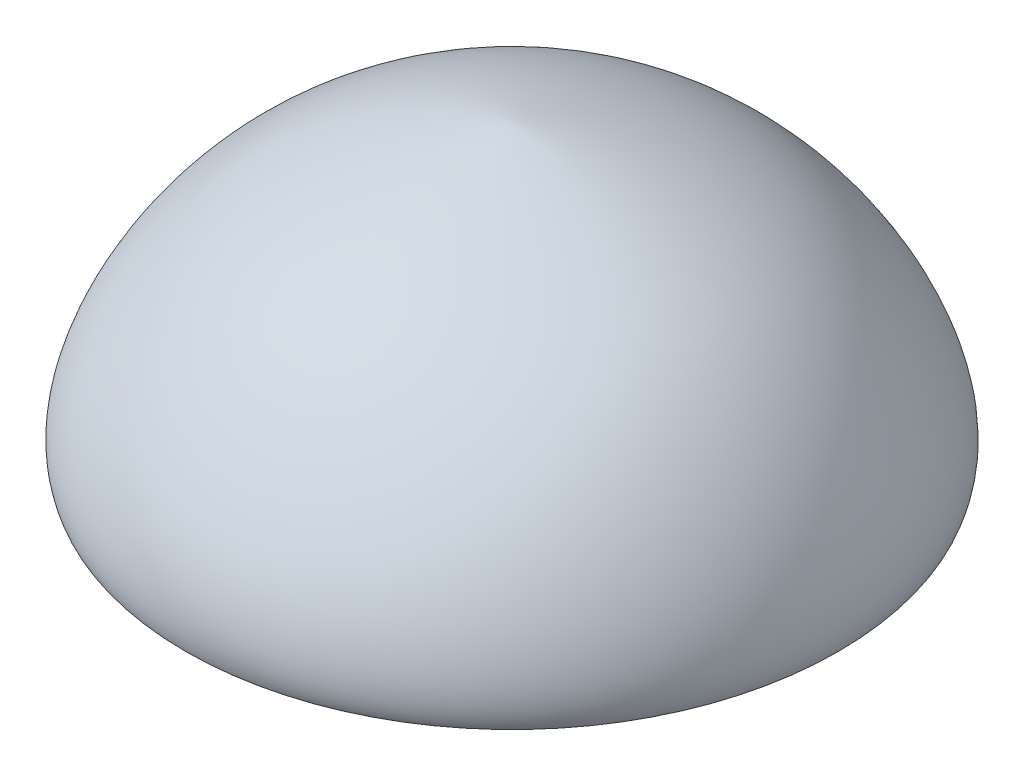
ISO-10303-21;
HEADER;
FILE_DESCRIPTION(('STEP AP214'),'2;1');
FILE_NAME('part.step','',(''),(''),'','','');
FILE_SCHEMA(('AUTOMOTIVE_DESIGN { 1 0 10303 214 1 1 1 1 }'));
ENDSEC;
DATA;
#1=APPLICATION_CONTEXT('core data for automotive mechanical design processes');
#2=APPLICATION_PROTOCOL_DEFINITION('international standard','automotive_design',2000,#1);
#3=PRODUCT_CONTEXT('',#1,'mechanical');
#4=PRODUCT('Part','Part','',(#3));
#5=PRODUCT_RELATED_PRODUCT_CATEGORY('part','',(#4));
#6=PRODUCT_DEFINITION_FORMATION('','',#4);
#7=PRODUCT_DEFINITION_CONTEXT('part definition',#1,'design');
#8=PRODUCT_DEFINITION('design','',#6,#7);
#9=PRODUCT_DEFINITION_SHAPE('','',#8);
#10=(LENGTH_UNIT() NAMED_UNIT(*) SI_UNIT(.MILLI.,.METRE.));
#11=(NAMED_UNIT(*) PLANE_ANGLE_UNIT() SI_UNIT($,.RADIAN.));
#12=(NAMED_UNIT(*) SI_UNIT($,.STERADIAN.) SOLID_ANGLE_UNIT());
#13=UNCERTAINTY_MEASURE_WITH_UNIT(LENGTH_MEASURE(1.E-05),#10,'distance_accuracy_value','');
#14=(GEOMETRIC_REPRESENTATION_CONTEXT(3) GLOBAL_UNCERTAINTY_ASSIGNED_CONTEXT((#13)) GLOBAL_UNIT_ASSIGNED_CONTEXT((#10,
#11,#12)) REPRESENTATION_CONTEXT('',''));
#15=CARTESIAN_POINT('',(0.,0.,0.));
#16=DIRECTION('',(0.,0.,1.));
#17=DIRECTION('',(1.,0.,0.));
#18=AXIS2_PLACEMENT_3D('',#15,#16,#17);
#19=CARTESIAN_POINT('',(0.5,0.,0.));
#20=CARTESIAN_POINT('',(0.525443724020926,0.0623045036922682,0.));
#21=CARTESIAN_POINT('',(0.389704349266153,0.378890471474151,0.));
#22=CARTESIAN_POINT('',(0.0254904385884982,0.45,0.));
#23=CARTESIAN_POINT('',(0.,0.45,0.));
#24=B_SPLINE_CURVE_WITH_KNOTS('',3,(#19,#20,#21,#22,#23),.UNSPECIFIED.,.F.,.F.,(4,1,4),(0.,
0.503823142963827,1.),.UNSPECIFIED.);
#25=CARTESIAN_POINT('',(0.,0.45,0.));
#26=DIRECTION('',(0.,1.,0.));
#27=AXIS1_PLACEMENT('',#25,#26);
#28=SURFACE_OF_REVOLUTION('',#24,#27);
#29=CARTESIAN_POINT('',(0.,0.45,0.));
#30=VERTEX_POINT('',#29);
#31=VERTEX_LOOP('',#30);
#32=FACE_BOUND('',#31,.T.);
#33=CARTESIAN_POINT('',(0.,0.,0.));
#34=DIRECTION('',(0.,1.,0.));
#35=DIRECTION('',(-1.,0.,0.));
#36=AXIS2_PLACEMENT_3D('',#33,#34,#35);
#37=CIRCLE('',#36,0.5);
#38=CARTESIAN_POINT('',(-0.5,0.,0.));
#39=VERTEX_POINT('',#38);
#40=EDGE_CURVE('E11',#39,#39,#37,.T.);
#41=ORIENTED_EDGE('',*,*,#40,.T.);
#42=EDGE_LOOP('',(#41));
#43=FACE_BOUND('',#42,.T.);
#44=ADVANCED_FACE('F34',(#32,#43),#28,.T.);
#45=CARTESIAN_POINT('',(0.,0.,0.));
#46=DIRECTION('',(0.,1.,0.));
#47=DIRECTION('',(-1.,0.,0.));
#48=AXIS2_PLACEMENT_3D('',#45,#46,#47);
#49=PLANE('',#48);
#50=ORIENTED_EDGE('',*,*,#40,.F.);
#51=EDGE_LOOP('',(#50));
#52=FACE_BOUND('',#51,.T.);
#53=ADVANCED_FACE('F44',(#52),#49,.F.);
#54=CLOSED_SHELL('',(#44,#53));
#55=MANIFOLD_SOLID_BREP('B2',#54);
#56=ADVANCED_BREP_SHAPE_REPRESENTATION('',(#18,#55),#14);
#57=SHAPE_DEFINITION_REPRESENTATION(#9,#56);
ENDSEC;
END-ISO-10303-21;
